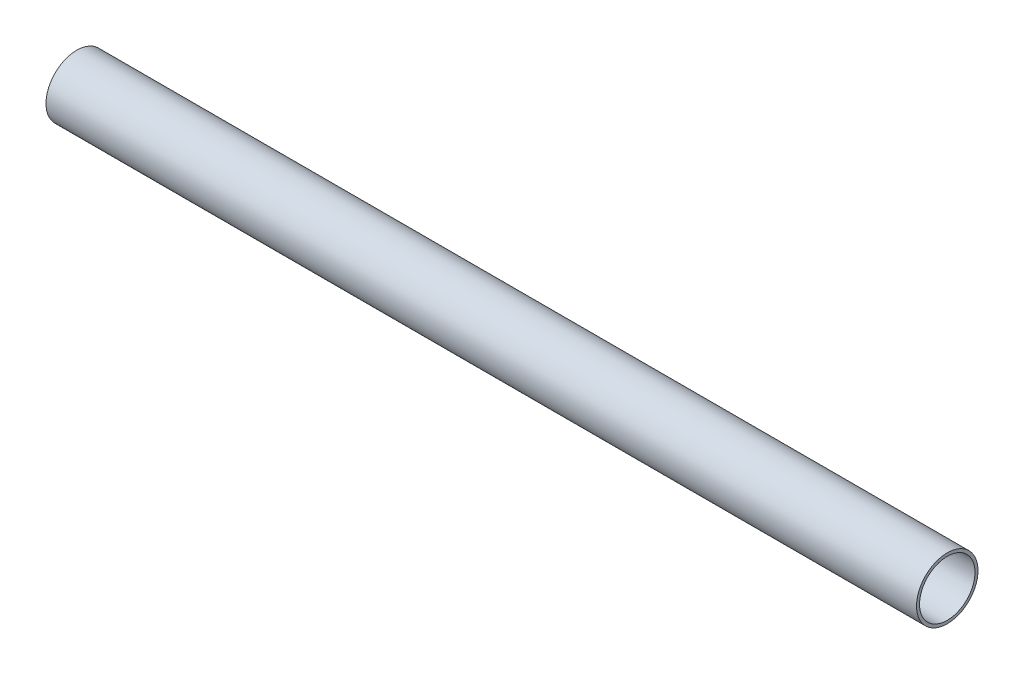
ISO-10303-21;
HEADER;
FILE_DESCRIPTION(('STEP AP214'),'2;1');
FILE_NAME('part.step','',(''),(''),'','','');
FILE_SCHEMA(('AUTOMOTIVE_DESIGN { 1 0 10303 214 1 1 1 1 }'));
ENDSEC;
DATA;
#1=APPLICATION_CONTEXT('core data for automotive mechanical design processes');
#2=APPLICATION_PROTOCOL_DEFINITION('international standard','automotive_design',2000,#1);
#3=PRODUCT_CONTEXT('',#1,'mechanical');
#4=PRODUCT('Part','Part','',(#3));
#5=PRODUCT_RELATED_PRODUCT_CATEGORY('part','',(#4));
#6=PRODUCT_DEFINITION_FORMATION('','',#4);
#7=PRODUCT_DEFINITION_CONTEXT('part definition',#1,'design');
#8=PRODUCT_DEFINITION('design','',#6,#7);
#9=PRODUCT_DEFINITION_SHAPE('','',#8);
#10=(LENGTH_UNIT() NAMED_UNIT(*) SI_UNIT(.MILLI.,.METRE.));
#11=(NAMED_UNIT(*) PLANE_ANGLE_UNIT() SI_UNIT($,.RADIAN.));
#12=(NAMED_UNIT(*) SI_UNIT($,.STERADIAN.) SOLID_ANGLE_UNIT());
#13=UNCERTAINTY_MEASURE_WITH_UNIT(LENGTH_MEASURE(1.E-05),#10,'distance_accuracy_value','');
#14=(GEOMETRIC_REPRESENTATION_CONTEXT(3) GLOBAL_UNCERTAINTY_ASSIGNED_CONTEXT((#13)) GLOBAL_UNIT_ASSIGNED_CONTEXT((#10,
#11,#12)) REPRESENTATION_CONTEXT('',''));
#15=CARTESIAN_POINT('',(0.,0.,0.));
#16=DIRECTION('',(0.,0.,1.));
#17=DIRECTION('',(1.,0.,0.));
#18=AXIS2_PLACEMENT_3D('',#15,#16,#17);
#19=CARTESIAN_POINT('',(-582.598230203423,-6.00044028862299,0.));
#20=DIRECTION('',(1.,0.,0.));
#21=DIRECTION('',(0.,1.,0.));
#22=AXIS2_PLACEMENT_3D('',#19,#20,#21);
#23=PLANE('',#22);
#24=CARTESIAN_POINT('',(-582.598230203423,-0.000440288622984425,0.));
#25=DIRECTION('',(-1.,0.,0.));
#26=DIRECTION('',(0.,-1.,0.));
#27=AXIS2_PLACEMENT_3D('',#24,#25,#26);
#28=CIRCLE('',#27,6.);
#29=CARTESIAN_POINT('',(-582.598230203423,-6.00044028862299,0.));
#30=VERTEX_POINT('',#29);
#31=EDGE_CURVE('E10',#30,#30,#28,.T.);
#32=ORIENTED_EDGE('',*,*,#31,.T.);
#33=EDGE_LOOP('',(#32));
#34=FACE_BOUND('',#33,.T.);
#35=CARTESIAN_POINT('',(-582.598230203423,-0.000440288622984425,0.));
#36=DIRECTION('',(-1.,0.,0.));
#37=DIRECTION('',(0.,-1.,0.));
#38=AXIS2_PLACEMENT_3D('',#35,#36,#37);
#39=CIRCLE('',#38,6.65);
#40=CARTESIAN_POINT('',(-582.598230203423,-6.65044028862299,0.));
#41=VERTEX_POINT('',#40);
#42=EDGE_CURVE('E46',#41,#41,#39,.T.);
#43=ORIENTED_EDGE('',*,*,#42,.F.);
#44=EDGE_LOOP('',(#43));
#45=FACE_BOUND('',#44,.T.);
#46=ADVANCED_FACE('F32',(#34,#45),#23,.T.);
#47=CARTESIAN_POINT('',(-766.248230203423,-0.000440288623012003,0.));
#48=DIRECTION('',(-1.,0.,0.));
#49=DIRECTION('',(0.,-1.,0.));
#50=AXIS2_PLACEMENT_3D('',#47,#48,#49);
#51=CYLINDRICAL_SURFACE('',#50,6.);
#52=CARTESIAN_POINT('',(-770.898230203423,-0.000440288623012702,0.));
#53=DIRECTION('',(-1.,0.,0.));
#54=DIRECTION('',(0.,-1.,0.));
#55=AXIS2_PLACEMENT_3D('',#52,#53,#54);
#56=CIRCLE('',#55,6.);
#57=CARTESIAN_POINT('',(-770.898230203423,-6.00044028862301,0.));
#58=VERTEX_POINT('',#57);
#59=EDGE_CURVE('E38',#58,#58,#56,.T.);
#60=ORIENTED_EDGE('',*,*,#59,.T.);
#61=EDGE_LOOP('',(#60));
#62=FACE_BOUND('',#61,.T.);
#63=ORIENTED_EDGE('',*,*,#31,.F.);
#64=EDGE_LOOP('',(#63));
#65=FACE_BOUND('',#64,.T.);
#66=ADVANCED_FACE('F56',(#62,#65),#51,.F.);
#67=CARTESIAN_POINT('',(-770.898230203423,-6.00044028862301,0.));
#68=DIRECTION('',(-1.,0.,0.));
#69=DIRECTION('',(0.,-1.,0.));
#70=AXIS2_PLACEMENT_3D('',#67,#68,#69);
#71=PLANE('',#70);
#72=CARTESIAN_POINT('',(-770.898230203423,-0.000440288623012702,0.));
#73=DIRECTION('',(-1.,0.,0.));
#74=DIRECTION('',(0.,-1.,0.));
#75=AXIS2_PLACEMENT_3D('',#72,#73,#74);
#76=CIRCLE('',#75,6.65);
#77=CARTESIAN_POINT('',(-770.898230203423,-6.65044028862301,0.));
#78=VERTEX_POINT('',#77);
#79=EDGE_CURVE('E42',#78,#78,#76,.T.);
#80=ORIENTED_EDGE('',*,*,#79,.T.);
#81=EDGE_LOOP('',(#80));
#82=FACE_BOUND('',#81,.T.);
#83=ORIENTED_EDGE('',*,*,#59,.F.);
#84=EDGE_LOOP('',(#83));
#85=FACE_BOUND('',#84,.T.);
#86=ADVANCED_FACE('F60',(#82,#85),#71,.T.);
#87=CARTESIAN_POINT('',(-766.248230203423,-0.000440288623012003,0.));
#88=DIRECTION('',(-1.,0.,0.));
#89=DIRECTION('',(0.,-1.,0.));
#90=AXIS2_PLACEMENT_3D('',#87,#88,#89);
#91=CYLINDRICAL_SURFACE('',#90,6.65);
#92=ORIENTED_EDGE('',*,*,#42,.T.);
#93=EDGE_LOOP('',(#92));
#94=FACE_BOUND('',#93,.T.);
#95=ORIENTED_EDGE('',*,*,#79,.F.);
#96=EDGE_LOOP('',(#95));
#97=FACE_BOUND('',#96,.T.);
#98=ADVANCED_FACE('F52',(#94,#97),#91,.T.);
#99=CLOSED_SHELL('',(#46,#66,#86,#98));
#100=MANIFOLD_SOLID_BREP('B2',#99);
#101=ADVANCED_BREP_SHAPE_REPRESENTATION('',(#18,#100),#14);
#102=SHAPE_DEFINITION_REPRESENTATION(#9,#101);
ENDSEC;
END-ISO-10303-21;
